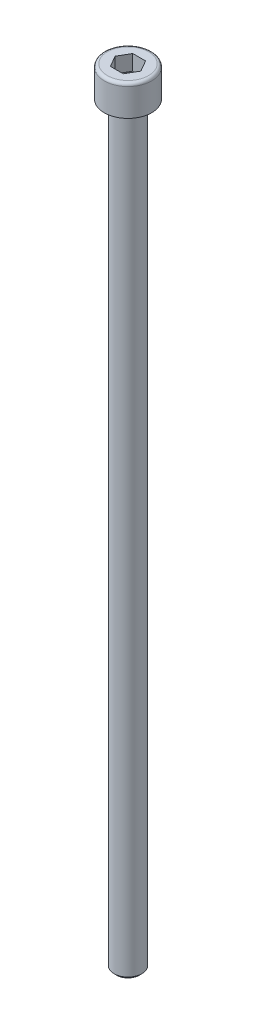
ISO-10303-21;
HEADER;
FILE_DESCRIPTION(('STEP AP214'),'2;1');
FILE_NAME('part.step','',(''),(''),'','','');
FILE_SCHEMA(('AUTOMOTIVE_DESIGN { 1 0 10303 214 1 1 1 1 }'));
ENDSEC;
DATA;
#1=APPLICATION_CONTEXT('core data for automotive mechanical design processes');
#2=APPLICATION_PROTOCOL_DEFINITION('international standard','automotive_design',2000,#1);
#3=PRODUCT_CONTEXT('',#1,'mechanical');
#4=PRODUCT('Part','Part','',(#3));
#5=PRODUCT_RELATED_PRODUCT_CATEGORY('part','',(#4));
#6=PRODUCT_DEFINITION_FORMATION('','',#4);
#7=PRODUCT_DEFINITION_CONTEXT('part definition',#1,'design');
#8=PRODUCT_DEFINITION('design','',#6,#7);
#9=PRODUCT_DEFINITION_SHAPE('','',#8);
#10=(LENGTH_UNIT() NAMED_UNIT(*) SI_UNIT(.MILLI.,.METRE.));
#11=(NAMED_UNIT(*) PLANE_ANGLE_UNIT() SI_UNIT($,.RADIAN.));
#12=(NAMED_UNIT(*) SI_UNIT($,.STERADIAN.) SOLID_ANGLE_UNIT());
#13=UNCERTAINTY_MEASURE_WITH_UNIT(LENGTH_MEASURE(1.E-05),#10,'distance_accuracy_value','');
#14=(GEOMETRIC_REPRESENTATION_CONTEXT(3) GLOBAL_UNCERTAINTY_ASSIGNED_CONTEXT((#13)) GLOBAL_UNIT_ASSIGNED_CONTEXT((#10,
#11,#12)) REPRESENTATION_CONTEXT('',''));
#15=CARTESIAN_POINT('',(0.,0.,0.));
#16=DIRECTION('',(0.,0.,1.));
#17=DIRECTION('',(1.,0.,0.));
#18=AXIS2_PLACEMENT_3D('',#15,#16,#17);
#19=CARTESIAN_POINT('',(-1.11022302462516E-13,-135.,0.));
#20=DIRECTION('',(0.,1.,0.));
#21=DIRECTION('',(0.,0.,1.00000000000001));
#22=AXIS2_PLACEMENT_3D('',#19,#20,#21);
#23=CYLINDRICAL_SURFACE('',#22,2.5);
#24=CARTESIAN_POINT('',(-1.11022302462516E-13,-134.5,0.));
#25=DIRECTION('',(0.,1.,0.));
#26=DIRECTION('',(0.,0.,1.00000000000001));
#27=AXIS2_PLACEMENT_3D('',#24,#25,#26);
#28=CIRCLE('',#27,2.5);
#29=CARTESIAN_POINT('',(-1.10467190950203E-13,-134.5,2.49999999999996));
#30=VERTEX_POINT('',#29);
#31=EDGE_CURVE('E33',#30,#30,#28,.T.);
#32=ORIENTED_EDGE('',*,*,#31,.T.);
#33=EDGE_LOOP('',(#32));
#34=FACE_BOUND('',#33,.T.);
#35=CARTESIAN_POINT('',(0.,0.,0.));
#36=DIRECTION('',(0.,1.,0.));
#37=DIRECTION('',(0.,0.,1.00000000000001));
#38=AXIS2_PLACEMENT_3D('',#35,#36,#37);
#39=CIRCLE('',#38,2.5);
#40=CARTESIAN_POINT('',(0.,0.,2.50000000000001));
#41=VERTEX_POINT('',#40);
#42=EDGE_CURVE('E144',#41,#41,#39,.T.);
#43=ORIENTED_EDGE('',*,*,#42,.F.);
#44=EDGE_LOOP('',(#43));
#45=FACE_BOUND('',#44,.T.);
#46=ADVANCED_FACE('F26',(#34,#45),#23,.T.);
#47=CARTESIAN_POINT('',(-1.11022302462516E-13,-135.,0.));
#48=DIRECTION('',(0.,1.,0.));
#49=DIRECTION('',(0.,0.,1.00000000000001));
#50=AXIS2_PLACEMENT_3D('',#47,#48,#49);
#51=PLANE('',#50);
#52=CARTESIAN_POINT('',(-1.11022302462516E-13,-135.,0.));
#53=DIRECTION('',(0.,1.,0.));
#54=DIRECTION('',(0.,0.,1.00000000000001));
#55=AXIS2_PLACEMENT_3D('',#52,#53,#54);
#56=CIRCLE('',#55,2.);
#57=CARTESIAN_POINT('',(-1.10578213252666E-13,-135.,1.99999999999995));
#58=VERTEX_POINT('',#57);
#59=EDGE_CURVE('E11',#58,#58,#56,.F.);
#60=ORIENTED_EDGE('',*,*,#59,.T.);
#61=EDGE_LOOP('',(#60));
#62=FACE_BOUND('',#61,.T.);
#63=ADVANCED_FACE('F154',(#62),#51,.F.);
#64=CARTESIAN_POINT('',(-1.11022302462516E-13,-134.5,0.));
#65=DIRECTION('',(0.,1.,0.));
#66=DIRECTION('',(0.,0.,1.00000000000001));
#67=AXIS2_PLACEMENT_3D('',#64,#65,#66);
#68=CONICAL_SURFACE('',#67,2.5,0.785398163397451);
#69=ORIENTED_EDGE('',*,*,#59,.F.);
#70=EDGE_LOOP('',(#69));
#71=FACE_BOUND('',#70,.T.);
#72=ORIENTED_EDGE('',*,*,#31,.F.);
#73=EDGE_LOOP('',(#72));
#74=FACE_BOUND('',#73,.T.);
#75=ADVANCED_FACE('F151',(#71,#74),#68,.T.);
#76=CARTESIAN_POINT('',(0.,0.,0.));
#77=DIRECTION('',(0.,1.,0.));
#78=DIRECTION('',(0.,0.,1.00000000000001));
#79=AXIS2_PLACEMENT_3D('',#76,#77,#78);
#80=PLANE('',#79);
#81=ORIENTED_EDGE('',*,*,#42,.T.);
#82=EDGE_LOOP('',(#81));
#83=FACE_BOUND('',#82,.T.);
#84=CARTESIAN_POINT('',(0.,0.,0.));
#85=DIRECTION('',(0.,1.,0.));
#86=DIRECTION('',(0.,0.,1.00000000000001));
#87=AXIS2_PLACEMENT_3D('',#84,#85,#86);
#88=CIRCLE('',#87,4.25);
#89=CARTESIAN_POINT('',(0.,0.,4.25000000000002));
#90=VERTEX_POINT('',#89);
#91=EDGE_CURVE('E141',#90,#90,#88,.T.);
#92=ORIENTED_EDGE('',*,*,#91,.F.);
#93=EDGE_LOOP('',(#92));
#94=FACE_BOUND('',#93,.T.);
#95=ADVANCED_FACE('F153',(#83,#94),#80,.F.);
#96=CARTESIAN_POINT('',(0.,5.50000000000007,0.));
#97=DIRECTION('',(0.,1.,0.));
#98=DIRECTION('',(0.,0.,1.00000000000001));
#99=AXIS2_PLACEMENT_3D('',#96,#97,#98);
#100=CYLINDRICAL_SURFACE('',#99,4.25);
#101=CARTESIAN_POINT('',(0.,4.95000000000007,0.));
#102=DIRECTION('',(0.,1.,0.));
#103=DIRECTION('',(0.,0.,1.00000000000001));
#104=AXIS2_PLACEMENT_3D('',#101,#102,#103);
#105=CIRCLE('',#104,4.25);
#106=CARTESIAN_POINT('',(0.,4.95000000000007,4.25000000000002));
#107=VERTEX_POINT('',#106);
#108=EDGE_CURVE('E138',#107,#107,#105,.T.);
#109=ORIENTED_EDGE('',*,*,#108,.F.);
#110=EDGE_LOOP('',(#109));
#111=FACE_BOUND('',#110,.T.);
#112=ORIENTED_EDGE('',*,*,#91,.T.);
#113=EDGE_LOOP('',(#112));
#114=FACE_BOUND('',#113,.T.);
#115=ADVANCED_FACE('F161',(#111,#114),#100,.T.);
#116=CARTESIAN_POINT('',(0.,4.95000000000007,0.));
#117=DIRECTION('',(0.,1.,0.));
#118=DIRECTION('',(0.,0.,1.00000000000001));
#119=AXIS2_PLACEMENT_3D('',#116,#117,#118);
#120=TOROIDAL_SURFACE('',#119,3.7,0.55);
#121=CARTESIAN_POINT('',(0.,5.50000000000007,0.));
#122=DIRECTION('',(0.,1.,0.));
#123=DIRECTION('',(0.,0.,1.00000000000001));
#124=AXIS2_PLACEMENT_3D('',#121,#122,#123);
#125=CIRCLE('',#124,3.7);
#126=CARTESIAN_POINT('',(0.,5.50000000000007,3.70000000000002));
#127=VERTEX_POINT('',#126);
#128=EDGE_CURVE('E133',#127,#127,#125,.T.);
#129=ORIENTED_EDGE('',*,*,#128,.F.);
#130=EDGE_LOOP('',(#129));
#131=FACE_BOUND('',#130,.T.);
#132=ORIENTED_EDGE('',*,*,#108,.T.);
#133=EDGE_LOOP('',(#132));
#134=FACE_BOUND('',#133,.T.);
#135=ADVANCED_FACE('F174',(#131,#134),#120,.T.);
#136=CARTESIAN_POINT('',(2.,5.50000000000007,0.));
#137=DIRECTION('',(0.,-1.,0.));
#138=DIRECTION('',(0.,0.,-1.00000000000001));
#139=AXIS2_PLACEMENT_3D('',#136,#137,#138);
#140=PLANE('',#139);
#141=DIRECTION('',(-1.00000000000001,0.,0.));
#142=VECTOR('',#141,1.);
#143=CARTESIAN_POINT('',(-1.15470053837929,5.50000000000007,-2.00000000000006));
#144=LINE('',#143,#142);
#145=CARTESIAN_POINT('',(1.15470053837918,5.50000000000007,-2.00000000000011));
#146=VERTEX_POINT('',#145);
#147=CARTESIAN_POINT('',(-1.15470053837929,5.50000000000007,-2.00000000000006));
#148=VERTEX_POINT('',#147);
#149=EDGE_CURVE('E40',#146,#148,#144,.T.);
#150=ORIENTED_EDGE('',*,*,#149,.F.);
#151=DIRECTION('',(-0.5,0.,-0.866025403784444));
#152=VECTOR('',#151,1.);
#153=CARTESIAN_POINT('',(1.15470053837918,5.50000000000007,-2.00000000000011));
#154=LINE('',#153,#152);
#155=CARTESIAN_POINT('',(2.30940107675848,5.50000000000007,-1.66533453693773E-13));
#156=VERTEX_POINT('',#155);
#157=EDGE_CURVE('E117',#156,#146,#154,.T.);
#158=ORIENTED_EDGE('',*,*,#157,.F.);
#159=DIRECTION('',(0.5,0.,-0.866025403784444));
#160=VECTOR('',#159,1.);
#161=CARTESIAN_POINT('',(1.15470053837929,5.50000000000007,2.));
#162=LINE('',#161,#160);
#163=CARTESIAN_POINT('',(1.15470053837929,5.50000000000007,2.));
#164=VERTEX_POINT('',#163);
#165=EDGE_CURVE('E254',#164,#156,#162,.T.);
#166=ORIENTED_EDGE('',*,*,#165,.F.);
#167=DIRECTION('',(1.00000000000001,0.,0.));
#168=VECTOR('',#167,1.);
#169=CARTESIAN_POINT('',(-1.15470053837929,5.50000000000007,1.99999999999995));
#170=LINE('',#169,#168);
#171=CARTESIAN_POINT('',(-1.15470053837929,5.50000000000007,1.99999999999995));
#172=VERTEX_POINT('',#171);
#173=EDGE_CURVE('E252',#172,#164,#170,.T.);
#174=ORIENTED_EDGE('',*,*,#173,.F.);
#175=DIRECTION('',(0.5,0.,0.866025403784444));
#176=VECTOR('',#175,1.);
#177=CARTESIAN_POINT('',(-1.15470053837929,5.50000000000007,1.99999999999995));
#178=LINE('',#177,#176);
#179=CARTESIAN_POINT('',(-2.30940107675864,5.50000000000007,-1.66533453693773E-13));
#180=VERTEX_POINT('',#179);
#181=EDGE_CURVE('E101',#180,#172,#178,.T.);
#182=ORIENTED_EDGE('',*,*,#181,.F.);
#183=DIRECTION('',(-0.5,0.,0.866025403784444));
#184=VECTOR('',#183,1.);
#185=CARTESIAN_POINT('',(-1.15470053837929,5.50000000000007,-2.00000000000006));
#186=LINE('',#185,#184);
#187=EDGE_CURVE('E97',#148,#180,#186,.T.);
#188=ORIENTED_EDGE('',*,*,#187,.F.);
#189=EDGE_LOOP('',(#150,#158,#166,#174,#182,#188));
#190=FACE_BOUND('',#189,.T.);
#191=ORIENTED_EDGE('',*,*,#128,.T.);
#192=EDGE_LOOP('',(#191));
#193=FACE_BOUND('',#192,.T.);
#194=ADVANCED_FACE('F98',(#190,#193),#140,.F.);
#195=CARTESIAN_POINT('',(1.15470053837918,2.75000000000007,-2.00000000000011));
#196=DIRECTION('',(0.866025403784444,0.,-0.5));
#197=DIRECTION('',(-0.5,0.,-0.866025403784444));
#198=AXIS2_PLACEMENT_3D('',#195,#196,#197);
#199=PLANE('',#198);
#200=ORIENTED_EDGE('',*,*,#157,.T.);
#201=DIRECTION('',(0.,1.,0.));
#202=VECTOR('',#201,1.);
#203=CARTESIAN_POINT('',(1.15470053837918,2.75000000000007,-2.00000000000011));
#204=LINE('',#203,#202);
#205=CARTESIAN_POINT('',(1.15470053837918,2.75000000000007,-2.00000000000011));
#206=VERTEX_POINT('',#205);
#207=EDGE_CURVE('E115',#206,#146,#204,.T.);
#208=ORIENTED_EDGE('',*,*,#207,.F.);
#209=DIRECTION('',(-0.5,0.,-0.866025403784444));
#210=VECTOR('',#209,1.);
#211=CARTESIAN_POINT('',(1.15470053837918,2.75000000000007,-2.00000000000011));
#212=LINE('',#211,#210);
#213=CARTESIAN_POINT('',(1.73205080756883,2.75000000000007,-1.00000000000011));
#214=VERTEX_POINT('',#213);
#215=EDGE_CURVE('E256',#214,#206,#212,.T.);
#216=ORIENTED_EDGE('',*,*,#215,.F.);
#217=CARTESIAN_POINT('',(2.30940107675848,2.75000000000007,-1.66533453693773E-13));
#218=VERTEX_POINT('',#217);
#219=EDGE_CURVE('E260',#218,#214,#212,.T.);
#220=ORIENTED_EDGE('',*,*,#219,.F.);
#221=DIRECTION('',(0.,1.,0.));
#222=VECTOR('',#221,1.);
#223=CARTESIAN_POINT('',(2.30940107675848,2.75000000000007,-1.66533453693773E-13));
#224=LINE('',#223,#222);
#225=EDGE_CURVE('E244',#218,#156,#224,.T.);
#226=ORIENTED_EDGE('',*,*,#225,.T.);
#227=EDGE_LOOP('',(#200,#208,#216,#220,#226));
#228=FACE_BOUND('',#227,.T.);
#229=ADVANCED_FACE('F181',(#228),#199,.F.);
#230=CARTESIAN_POINT('',(1.15470053837929,2.75000000000007,2.));
#231=DIRECTION('',(0.866025403784444,0.,0.5));
#232=DIRECTION('',(0.5,0.,-0.866025403784444));
#233=AXIS2_PLACEMENT_3D('',#230,#231,#232);
#234=PLANE('',#233);
#235=ORIENTED_EDGE('',*,*,#165,.T.);
#236=ORIENTED_EDGE('',*,*,#225,.F.);
#237=DIRECTION('',(0.5,0.,-0.866025403784444));
#238=VECTOR('',#237,1.);
#239=CARTESIAN_POINT('',(1.15470053837929,2.75000000000007,2.));
#240=LINE('',#239,#238);
#241=CARTESIAN_POINT('',(1.73205080756883,2.75000000000007,1.));
#242=VERTEX_POINT('',#241);
#243=EDGE_CURVE('E240',#242,#218,#240,.T.);
#244=ORIENTED_EDGE('',*,*,#243,.F.);
#245=CARTESIAN_POINT('',(1.15470053837929,2.75000000000007,2.));
#246=VERTEX_POINT('',#245);
#247=EDGE_CURVE('E48',#246,#242,#240,.T.);
#248=ORIENTED_EDGE('',*,*,#247,.F.);
#249=DIRECTION('',(0.,1.,0.));
#250=VECTOR('',#249,1.);
#251=CARTESIAN_POINT('',(1.15470053837929,2.75000000000007,2.));
#252=LINE('',#251,#250);
#253=EDGE_CURVE('E234',#246,#164,#252,.T.);
#254=ORIENTED_EDGE('',*,*,#253,.T.);
#255=EDGE_LOOP('',(#235,#236,#244,#248,#254));
#256=FACE_BOUND('',#255,.T.);
#257=ADVANCED_FACE('F189',(#256),#234,.F.);
#258=CARTESIAN_POINT('',(-1.15470053837929,2.75000000000007,1.99999999999995));
#259=DIRECTION('',(0.,0.,1.00000000000001));
#260=DIRECTION('',(1.00000000000001,0.,0.));
#261=AXIS2_PLACEMENT_3D('',#258,#259,#260);
#262=PLANE('',#261);
#263=ORIENTED_EDGE('',*,*,#173,.T.);
#264=ORIENTED_EDGE('',*,*,#253,.F.);
#265=DIRECTION('',(1.00000000000001,0.,0.));
#266=VECTOR('',#265,1.);
#267=CARTESIAN_POINT('',(-1.15470053837929,2.75000000000007,1.99999999999995));
#268=LINE('',#267,#266);
#269=CARTESIAN_POINT('',(0.,2.75000000000007,1.99999999999984));
#270=VERTEX_POINT('',#269);
#271=EDGE_CURVE('E223',#270,#246,#268,.T.);
#272=ORIENTED_EDGE('',*,*,#271,.F.);
#273=CARTESIAN_POINT('',(-1.15470053837929,2.75000000000007,1.99999999999995));
#274=VERTEX_POINT('',#273);
#275=EDGE_CURVE('E232',#274,#270,#268,.T.);
#276=ORIENTED_EDGE('',*,*,#275,.F.);
#277=DIRECTION('',(0.,1.,0.));
#278=VECTOR('',#277,1.);
#279=CARTESIAN_POINT('',(-1.15470053837929,2.75000000000007,1.99999999999995));
#280=LINE('',#279,#278);
#281=EDGE_CURVE('E125',#274,#172,#280,.T.);
#282=ORIENTED_EDGE('',*,*,#281,.T.);
#283=EDGE_LOOP('',(#263,#264,#272,#276,#282));
#284=FACE_BOUND('',#283,.T.);
#285=ADVANCED_FACE('F199',(#284),#262,.F.);
#286=CARTESIAN_POINT('',(-1.15470053837929,2.75000000000007,1.99999999999995));
#287=DIRECTION('',(-0.866025403784444,0.,0.5));
#288=DIRECTION('',(0.5,0.,0.866025403784444));
#289=AXIS2_PLACEMENT_3D('',#286,#287,#288);
#290=PLANE('',#289);
#291=ORIENTED_EDGE('',*,*,#181,.T.);
#292=ORIENTED_EDGE('',*,*,#281,.F.);
#293=DIRECTION('',(0.5,0.,0.866025403784444));
#294=VECTOR('',#293,1.);
#295=CARTESIAN_POINT('',(-1.15470053837929,2.75000000000007,1.99999999999995));
#296=LINE('',#295,#294);
#297=CARTESIAN_POINT('',(-1.732050807569,2.75000000000007,0.999999999999834));
#298=VERTEX_POINT('',#297);
#299=EDGE_CURVE('E238',#298,#274,#296,.T.);
#300=ORIENTED_EDGE('',*,*,#299,.F.);
#301=CARTESIAN_POINT('',(-2.30940107675864,2.75000000000007,-1.66533453693773E-13));
#302=VERTEX_POINT('',#301);
#303=EDGE_CURVE('E235',#302,#298,#296,.T.);
#304=ORIENTED_EDGE('',*,*,#303,.F.);
#305=DIRECTION('',(0.,1.,0.));
#306=VECTOR('',#305,1.);
#307=CARTESIAN_POINT('',(-2.30940107675864,2.75000000000007,-1.66533453693773E-13));
#308=LINE('',#307,#306);
#309=EDGE_CURVE('E123',#302,#180,#308,.T.);
#310=ORIENTED_EDGE('',*,*,#309,.T.);
#311=EDGE_LOOP('',(#291,#292,#300,#304,#310));
#312=FACE_BOUND('',#311,.T.);
#313=ADVANCED_FACE('F196',(#312),#290,.F.);
#314=CARTESIAN_POINT('',(-1.15470053837929,2.75000000000007,-2.00000000000006));
#315=DIRECTION('',(-0.866025403784444,0.,-0.5));
#316=DIRECTION('',(-0.5,0.,0.866025403784444));
#317=AXIS2_PLACEMENT_3D('',#314,#315,#316);
#318=PLANE('',#317);
#319=ORIENTED_EDGE('',*,*,#187,.T.);
#320=ORIENTED_EDGE('',*,*,#309,.F.);
#321=DIRECTION('',(-0.5,0.,0.866025403784444));
#322=VECTOR('',#321,1.);
#323=CARTESIAN_POINT('',(-1.15470053837929,2.75000000000007,-2.00000000000006));
#324=LINE('',#323,#322);
#325=CARTESIAN_POINT('',(-1.73205080756889,2.75000000000007,-1.00000000000006));
#326=VERTEX_POINT('',#325);
#327=EDGE_CURVE('E267',#326,#302,#324,.T.);
#328=ORIENTED_EDGE('',*,*,#327,.F.);
#329=CARTESIAN_POINT('',(-1.15470053837929,2.75000000000007,-2.00000000000006));
#330=VERTEX_POINT('',#329);
#331=EDGE_CURVE('E122',#330,#326,#324,.T.);
#332=ORIENTED_EDGE('',*,*,#331,.F.);
#333=DIRECTION('',(0.,1.,0.));
#334=VECTOR('',#333,1.);
#335=CARTESIAN_POINT('',(-1.15470053837929,2.75000000000007,-2.00000000000006));
#336=LINE('',#335,#334);
#337=EDGE_CURVE('E111',#330,#148,#336,.T.);
#338=ORIENTED_EDGE('',*,*,#337,.T.);
#339=EDGE_LOOP('',(#319,#320,#328,#332,#338));
#340=FACE_BOUND('',#339,.T.);
#341=ADVANCED_FACE('F119',(#340),#318,.F.);
#342=CARTESIAN_POINT('',(-1.15470053837929,2.75000000000007,-2.00000000000006));
#343=DIRECTION('',(0.,0.,-1.00000000000001));
#344=DIRECTION('',(-1.00000000000001,0.,0.));
#345=AXIS2_PLACEMENT_3D('',#342,#343,#344);
#346=PLANE('',#345);
#347=ORIENTED_EDGE('',*,*,#149,.T.);
#348=ORIENTED_EDGE('',*,*,#337,.F.);
#349=DIRECTION('',(-1.00000000000001,0.,0.));
#350=VECTOR('',#349,1.);
#351=CARTESIAN_POINT('',(-1.15470053837929,2.75000000000007,-2.00000000000006));
#352=LINE('',#351,#350);
#353=CARTESIAN_POINT('',(0.,2.75000000000007,-2.00000000000017));
#354=VERTEX_POINT('',#353);
#355=EDGE_CURVE('E263',#354,#330,#352,.T.);
#356=ORIENTED_EDGE('',*,*,#355,.F.);
#357=EDGE_CURVE('E264',#206,#354,#352,.T.);
#358=ORIENTED_EDGE('',*,*,#357,.F.);
#359=ORIENTED_EDGE('',*,*,#207,.T.);
#360=EDGE_LOOP('',(#347,#348,#356,#358,#359));
#361=FACE_BOUND('',#360,.T.);
#362=ADVANCED_FACE('F109',(#361),#346,.F.);
#363=CARTESIAN_POINT('',(3.46410161513777,2.75000000000007,2.));
#364=DIRECTION('',(0.,1.,0.));
#365=DIRECTION('',(0.,0.,1.00000000000001));
#366=AXIS2_PLACEMENT_3D('',#363,#364,#365);
#367=PLANE('',#366);
#368=CARTESIAN_POINT('',(0.,2.75000000000007,0.));
#369=DIRECTION('',(0.,1.,0.));
#370=DIRECTION('',(0.,0.,1.00000000000001));
#371=AXIS2_PLACEMENT_3D('',#368,#369,#370);
#372=CIRCLE('',#371,2.);
#373=EDGE_CURVE('E135',#298,#270,#372,.T.);
#374=ORIENTED_EDGE('',*,*,#373,.F.);
#375=ORIENTED_EDGE('',*,*,#299,.T.);
#376=ORIENTED_EDGE('',*,*,#275,.T.);
#377=EDGE_LOOP('',(#374,#375,#376));
#378=FACE_BOUND('',#377,.T.);
#379=ADVANCED_FACE('F193',(#378),#367,.T.);
#380=EDGE_CURVE('E243',#326,#298,#372,.T.);
#381=ORIENTED_EDGE('',*,*,#380,.F.);
#382=ORIENTED_EDGE('',*,*,#327,.T.);
#383=ORIENTED_EDGE('',*,*,#303,.T.);
#384=EDGE_LOOP('',(#381,#382,#383));
#385=FACE_BOUND('',#384,.T.);
#386=ADVANCED_FACE('F208',(#385),#367,.T.);
#387=EDGE_CURVE('E245',#354,#326,#372,.T.);
#388=ORIENTED_EDGE('',*,*,#387,.F.);
#389=ORIENTED_EDGE('',*,*,#355,.T.);
#390=ORIENTED_EDGE('',*,*,#331,.T.);
#391=EDGE_LOOP('',(#388,#389,#390));
#392=FACE_BOUND('',#391,.T.);
#393=ADVANCED_FACE('F213',(#392),#367,.T.);
#394=EDGE_CURVE('E273',#214,#354,#372,.T.);
#395=ORIENTED_EDGE('',*,*,#394,.F.);
#396=ORIENTED_EDGE('',*,*,#215,.T.);
#397=ORIENTED_EDGE('',*,*,#357,.T.);
#398=EDGE_LOOP('',(#395,#396,#397));
#399=FACE_BOUND('',#398,.T.);
#400=ADVANCED_FACE('F220',(#399),#367,.T.);
#401=EDGE_CURVE('E134',#242,#214,#372,.T.);
#402=ORIENTED_EDGE('',*,*,#401,.F.);
#403=ORIENTED_EDGE('',*,*,#243,.T.);
#404=ORIENTED_EDGE('',*,*,#219,.T.);
#405=EDGE_LOOP('',(#402,#403,#404));
#406=FACE_BOUND('',#405,.T.);
#407=ADVANCED_FACE('F216',(#406),#367,.T.);
#408=EDGE_CURVE('E130',#270,#242,#372,.T.);
#409=ORIENTED_EDGE('',*,*,#408,.F.);
#410=ORIENTED_EDGE('',*,*,#271,.T.);
#411=ORIENTED_EDGE('',*,*,#247,.T.);
#412=EDGE_LOOP('',(#409,#410,#411));
#413=FACE_BOUND('',#412,.T.);
#414=ADVANCED_FACE('F185',(#413),#367,.T.);
#415=CARTESIAN_POINT('',(0.,2.75000000000007,0.));
#416=DIRECTION('',(0.,1.,0.));
#417=DIRECTION('',(0.,0.,1.00000000000001));
#418=AXIS2_PLACEMENT_3D('',#415,#416,#417);
#419=CONICAL_SURFACE('',#418,2.,1.04719755119659);
#420=CARTESIAN_POINT('',(0.,1.59529946162081,0.));
#421=VERTEX_POINT('',#420);
#422=VERTEX_LOOP('',#421);
#423=FACE_BOUND('',#422,.T.);
#424=ORIENTED_EDGE('',*,*,#408,.T.);
#425=ORIENTED_EDGE('',*,*,#401,.T.);
#426=ORIENTED_EDGE('',*,*,#394,.T.);
#427=ORIENTED_EDGE('',*,*,#387,.T.);
#428=ORIENTED_EDGE('',*,*,#380,.T.);
#429=ORIENTED_EDGE('',*,*,#373,.T.);
#430=EDGE_LOOP('',(#424,#425,#426,#427,#428,#429));
#431=FACE_BOUND('',#430,.T.);
#432=ADVANCED_FACE('F182',(#423,#431),#419,.F.);
#433=CLOSED_SHELL('',(#46,#63,#75,#95,#115,#135,#194,#229,#257,#285,#313,#341,#362,#379,#386,
#393,#400,#407,#414,#432));
#434=MANIFOLD_SOLID_BREP('B2',#433);
#435=ADVANCED_BREP_SHAPE_REPRESENTATION('',(#18,#434),#14);
#436=SHAPE_DEFINITION_REPRESENTATION(#9,#435);
ENDSEC;
END-ISO-10303-21;
